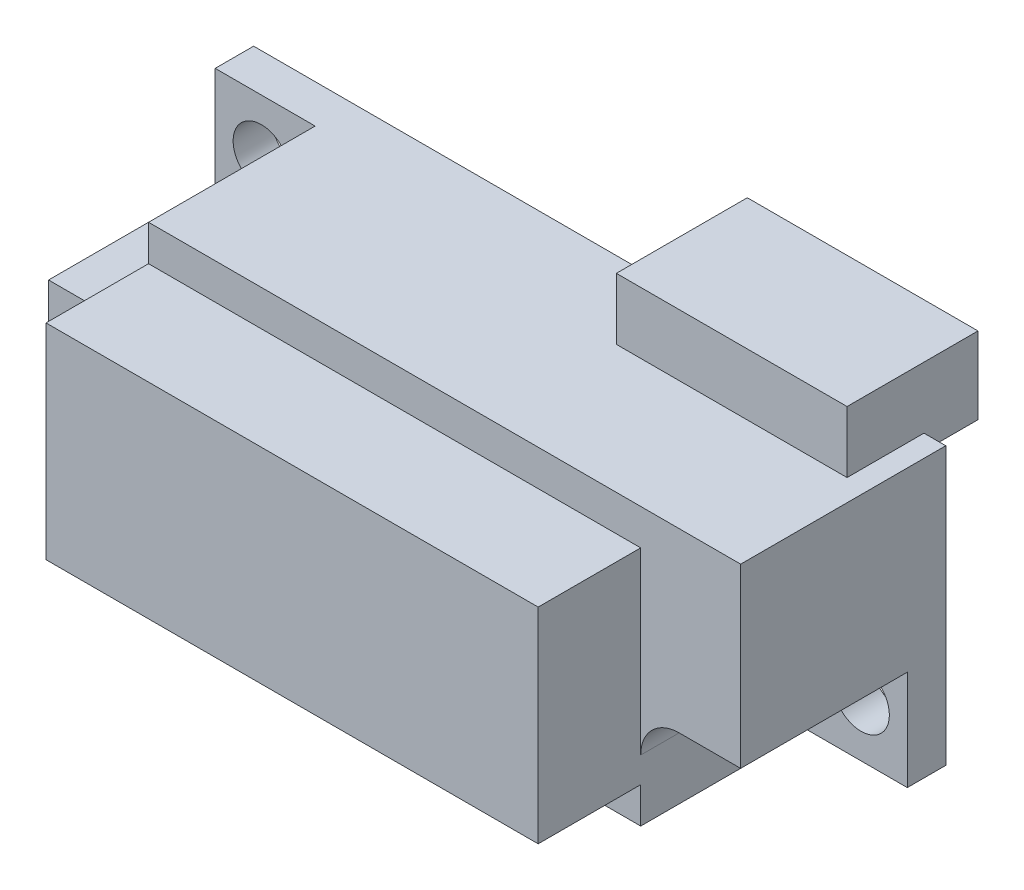
ISO-10303-21;
HEADER;
FILE_DESCRIPTION(('STEP AP214'),'2;1');
FILE_NAME('part.step','',(''),(''),'','','');
FILE_SCHEMA(('AUTOMOTIVE_DESIGN { 1 0 10303 214 1 1 1 1 }'));
ENDSEC;
DATA;
#1=APPLICATION_CONTEXT('core data for automotive mechanical design processes');
#2=APPLICATION_PROTOCOL_DEFINITION('international standard','automotive_design',2000,#1);
#3=PRODUCT_CONTEXT('',#1,'mechanical');
#4=PRODUCT('Part','Part','',(#3));
#5=PRODUCT_RELATED_PRODUCT_CATEGORY('part','',(#4));
#6=PRODUCT_DEFINITION_FORMATION('','',#4);
#7=PRODUCT_DEFINITION_CONTEXT('part definition',#1,'design');
#8=PRODUCT_DEFINITION('design','',#6,#7);
#9=PRODUCT_DEFINITION_SHAPE('','',#8);
#10=(LENGTH_UNIT() NAMED_UNIT(*) SI_UNIT(.MILLI.,.METRE.));
#11=(NAMED_UNIT(*) PLANE_ANGLE_UNIT() SI_UNIT($,.RADIAN.));
#12=(NAMED_UNIT(*) SI_UNIT($,.STERADIAN.) SOLID_ANGLE_UNIT());
#13=UNCERTAINTY_MEASURE_WITH_UNIT(LENGTH_MEASURE(1.E-05),#10,'distance_accuracy_value','');
#14=(GEOMETRIC_REPRESENTATION_CONTEXT(3) GLOBAL_UNCERTAINTY_ASSIGNED_CONTEXT((#13)) GLOBAL_UNIT_ASSIGNED_CONTEXT((#10,
#11,#12)) REPRESENTATION_CONTEXT('',''));
#15=CARTESIAN_POINT('',(0.,0.,0.));
#16=DIRECTION('',(0.,0.,1.));
#17=DIRECTION('',(1.,0.,0.));
#18=AXIS2_PLACEMENT_3D('',#15,#16,#17);
#19=CARTESIAN_POINT('',(-26.1452834227024,14.8512324203786,12.));
#20=DIRECTION('',(1.,0.,0.));
#21=DIRECTION('',(0.,1.,0.));
#22=AXIS2_PLACEMENT_3D('',#19,#20,#21);
#23=PLANE('',#22);
#24=DIRECTION('',(0.,-1.,0.));
#25=VECTOR('',#24,1.);
#26=CARTESIAN_POINT('',(-26.1452834227024,14.8512324203786,8.));
#27=LINE('',#26,#25);
#28=CARTESIAN_POINT('',(-26.1452834227024,10.9512324203803,8.));
#29=VERTEX_POINT('',#28);
#30=CARTESIAN_POINT('',(-26.1452834227024,4.05123242037859,8.));
#31=VERTEX_POINT('',#30);
#32=EDGE_CURVE('E246',#29,#31,#27,.T.);
#33=ORIENTED_EDGE('',*,*,#32,.F.);
#34=DIRECTION('',(0.,0.,1.));
#35=VECTOR('',#34,1.);
#36=CARTESIAN_POINT('',(-26.1452834227024,10.9512324203803,1.5));
#37=LINE('',#36,#35);
#38=CARTESIAN_POINT('',(-26.1452834227024,10.9512324203803,1.5));
#39=VERTEX_POINT('',#38);
#40=EDGE_CURVE('E311',#39,#29,#37,.T.);
#41=ORIENTED_EDGE('',*,*,#40,.F.);
#42=DIRECTION('',(0.,-1.,0.));
#43=VECTOR('',#42,1.);
#44=CARTESIAN_POINT('',(-26.1452834227024,14.8512324203786,1.5));
#45=LINE('',#44,#43);
#46=CARTESIAN_POINT('',(-26.1452834227024,14.8512324203786,1.5));
#47=VERTEX_POINT('',#46);
#48=EDGE_CURVE('E301',#47,#39,#45,.T.);
#49=ORIENTED_EDGE('',*,*,#48,.F.);
#50=DIRECTION('',(0.,0.,-1.));
#51=VECTOR('',#50,1.);
#52=CARTESIAN_POINT('',(-26.1452834227024,14.8512324203786,12.));
#53=LINE('',#52,#51);
#54=CARTESIAN_POINT('',(-26.1452834227024,14.8512324203786,0.));
#55=VERTEX_POINT('',#54);
#56=EDGE_CURVE('E332',#47,#55,#53,.T.);
#57=ORIENTED_EDGE('',*,*,#56,.T.);
#58=DIRECTION('',(0.,-1.,0.));
#59=VECTOR('',#58,1.);
#60=CARTESIAN_POINT('',(-26.1452834227024,14.8512324203786,0.));
#61=LINE('',#60,#59);
#62=CARTESIAN_POINT('',(-26.1452834227025,4.05123242037859,0.));
#63=VERTEX_POINT('',#62);
#64=EDGE_CURVE('E317',#55,#63,#61,.T.);
#65=ORIENTED_EDGE('',*,*,#64,.T.);
#66=DIRECTION('',(0.,0.,-1.));
#67=VECTOR('',#66,1.);
#68=CARTESIAN_POINT('',(-26.1452834227025,4.05123242037859,12.));
#69=LINE('',#68,#67);
#70=EDGE_CURVE('E339',#31,#63,#69,.T.);
#71=ORIENTED_EDGE('',*,*,#70,.F.);
#72=EDGE_LOOP('',(#33,#41,#49,#57,#65,#71));
#73=FACE_BOUND('',#72,.T.);
#74=ADVANCED_FACE('F35',(#73),#23,.F.);
#75=CARTESIAN_POINT('',(-26.1452834227025,4.05123242037859,12.));
#76=DIRECTION('',(0.,1.,0.));
#77=DIRECTION('',(0.,0.,1.));
#78=AXIS2_PLACEMENT_3D('',#75,#76,#77);
#79=PLANE('',#78);
#80=DIRECTION('',(1.,0.,0.));
#81=VECTOR('',#80,1.);
#82=CARTESIAN_POINT('',(-26.1452834227024,4.05123242037859,8.));
#83=LINE('',#82,#81);
#84=CARTESIAN_POINT('',(-3.04528342269798,4.05123242037859,8.));
#85=VERTEX_POINT('',#84);
#86=EDGE_CURVE('E255',#31,#85,#83,.T.);
#87=ORIENTED_EDGE('',*,*,#86,.F.);
#88=ORIENTED_EDGE('',*,*,#70,.T.);
#89=DIRECTION('',(1.,0.,0.));
#90=VECTOR('',#89,1.);
#91=CARTESIAN_POINT('',(-26.1452834227025,4.05123242037859,0.));
#92=LINE('',#91,#90);
#93=CARTESIAN_POINT('',(0.85471657729755,4.05123242037859,0.));
#94=VERTEX_POINT('',#93);
#95=EDGE_CURVE('E322',#63,#94,#92,.T.);
#96=ORIENTED_EDGE('',*,*,#95,.T.);
#97=DIRECTION('',(0.,0.,-1.));
#98=VECTOR('',#97,1.);
#99=CARTESIAN_POINT('',(0.85471657729755,4.05123242037859,12.));
#100=LINE('',#99,#98);
#101=CARTESIAN_POINT('',(0.85471657729755,4.05123242037859,1.5));
#102=VERTEX_POINT('',#101);
#103=EDGE_CURVE('E337',#102,#94,#100,.T.);
#104=ORIENTED_EDGE('',*,*,#103,.F.);
#105=DIRECTION('',(1.,0.,0.));
#106=VECTOR('',#105,1.);
#107=CARTESIAN_POINT('',(-3.04528342269798,4.05123242037859,1.5));
#108=LINE('',#107,#106);
#109=CARTESIAN_POINT('',(-3.04528342269798,4.05123242037859,1.5));
#110=VERTEX_POINT('',#109);
#111=EDGE_CURVE('E286',#110,#102,#108,.T.);
#112=ORIENTED_EDGE('',*,*,#111,.F.);
#113=DIRECTION('',(0.,0.,1.));
#114=VECTOR('',#113,1.);
#115=CARTESIAN_POINT('',(-3.04528342269798,4.05123242037859,1.5));
#116=LINE('',#115,#114);
#117=EDGE_CURVE('E292',#110,#85,#116,.T.);
#118=ORIENTED_EDGE('',*,*,#117,.T.);
#119=EDGE_LOOP('',(#87,#88,#96,#104,#112,#118));
#120=FACE_BOUND('',#119,.T.);
#121=ADVANCED_FACE('F409',(#120),#79,.F.);
#122=CARTESIAN_POINT('',(0.854716577297548,14.8512324203786,12.));
#123=DIRECTION('',(-1.,0.,0.));
#124=DIRECTION('',(0.,-1.,0.));
#125=AXIS2_PLACEMENT_3D('',#122,#123,#124);
#126=PLANE('',#125);
#127=DIRECTION('',(0.,1.,0.));
#128=VECTOR('',#127,1.);
#129=CARTESIAN_POINT('',(0.85471657729755,14.8512324203786,8.));
#130=LINE('',#129,#128);
#131=CARTESIAN_POINT('',(0.85471657729755,7.95123242037313,8.));
#132=VERTEX_POINT('',#131);
#133=CARTESIAN_POINT('',(0.85471657729755,14.8512324203786,8.));
#134=VERTEX_POINT('',#133);
#135=EDGE_CURVE('E257',#132,#134,#130,.T.);
#136=ORIENTED_EDGE('',*,*,#135,.F.);
#137=DIRECTION('',(0.,0.,1.));
#138=VECTOR('',#137,1.);
#139=CARTESIAN_POINT('',(0.85471657729755,7.95123242037313,1.5));
#140=LINE('',#139,#138);
#141=CARTESIAN_POINT('',(0.85471657729755,7.95123242037313,1.5));
#142=VERTEX_POINT('',#141);
#143=EDGE_CURVE('E295',#142,#132,#140,.T.);
#144=ORIENTED_EDGE('',*,*,#143,.F.);
#145=DIRECTION('',(0.,1.,0.));
#146=VECTOR('',#145,1.);
#147=CARTESIAN_POINT('',(0.85471657729755,7.95123242037313,1.5));
#148=LINE('',#147,#146);
#149=EDGE_CURVE('E288',#102,#142,#148,.T.);
#150=ORIENTED_EDGE('',*,*,#149,.F.);
#151=ORIENTED_EDGE('',*,*,#103,.T.);
#152=DIRECTION('',(0.,1.,0.));
#153=VECTOR('',#152,1.);
#154=CARTESIAN_POINT('',(0.854716577297548,14.8512324203786,0.));
#155=LINE('',#154,#153);
#156=CARTESIAN_POINT('',(0.854716577297548,14.8512324203786,0.));
#157=VERTEX_POINT('',#156);
#158=EDGE_CURVE('E325',#94,#157,#155,.T.);
#159=ORIENTED_EDGE('',*,*,#158,.T.);
#160=DIRECTION('',(0.,0.,-1.));
#161=VECTOR('',#160,1.);
#162=CARTESIAN_POINT('',(0.854716577297548,14.8512324203786,12.));
#163=LINE('',#162,#161);
#164=EDGE_CURVE('E335',#134,#157,#163,.T.);
#165=ORIENTED_EDGE('',*,*,#164,.F.);
#166=EDGE_LOOP('',(#136,#144,#150,#151,#159,#165));
#167=FACE_BOUND('',#166,.T.);
#168=ADVANCED_FACE('F371',(#167),#126,.F.);
#169=CARTESIAN_POINT('',(-26.1452834227024,14.8512324203786,12.));
#170=DIRECTION('',(0.,-1.,0.));
#171=DIRECTION('',(0.,0.,-1.));
#172=AXIS2_PLACEMENT_3D('',#169,#170,#171);
#173=PLANE('',#172);
#174=DIRECTION('',(-1.,0.,0.));
#175=VECTOR('',#174,1.);
#176=CARTESIAN_POINT('',(-26.1452834227024,14.8512324203786,0.));
#177=LINE('',#176,#175);
#178=CARTESIAN_POINT('',(0.00471657729754944,14.8512324203786,0.));
#179=VERTEX_POINT('',#178);
#180=EDGE_CURVE('E329',#157,#179,#177,.T.);
#181=ORIENTED_EDGE('',*,*,#180,.T.);
#182=DIRECTION('',(0.,0.,1.));
#183=VECTOR('',#182,1.);
#184=CARTESIAN_POINT('',(0.00471657729755187,14.8512324203786,12.));
#185=LINE('',#184,#183);
#186=CARTESIAN_POINT('',(0.00471657729754944,14.8512324203786,3.));
#187=VERTEX_POINT('',#186);
#188=EDGE_CURVE('E224',#179,#187,#185,.T.);
#189=ORIENTED_EDGE('',*,*,#188,.T.);
#190=DIRECTION('',(1.,0.,0.));
#191=VECTOR('',#190,1.);
#192=CARTESIAN_POINT('',(-26.1452834227024,14.8512324203786,3.));
#193=LINE('',#192,#191);
#194=CARTESIAN_POINT('',(-8.99528342270245,14.8512324203786,3.));
#195=VERTEX_POINT('',#194);
#196=EDGE_CURVE('E11',#195,#187,#193,.T.);
#197=ORIENTED_EDGE('',*,*,#196,.F.);
#198=DIRECTION('',(0.,0.,-1.));
#199=VECTOR('',#198,1.);
#200=CARTESIAN_POINT('',(-8.99528342270245,14.8512324203786,12.));
#201=LINE('',#200,#199);
#202=CARTESIAN_POINT('',(-8.99528342270245,14.8512324203786,0.));
#203=VERTEX_POINT('',#202);
#204=EDGE_CURVE('E218',#195,#203,#201,.T.);
#205=ORIENTED_EDGE('',*,*,#204,.T.);
#206=EDGE_CURVE('E328',#203,#55,#177,.T.);
#207=ORIENTED_EDGE('',*,*,#206,.T.);
#208=ORIENTED_EDGE('',*,*,#56,.F.);
#209=DIRECTION('',(-1.,0.,0.));
#210=VECTOR('',#209,1.);
#211=CARTESIAN_POINT('',(-26.1452834227024,14.8512324203786,1.5));
#212=LINE('',#211,#210);
#213=CARTESIAN_POINT('',(-22.245283422704,14.8512324203786,1.5));
#214=VERTEX_POINT('',#213);
#215=EDGE_CURVE('E309',#214,#47,#212,.T.);
#216=ORIENTED_EDGE('',*,*,#215,.F.);
#217=DIRECTION('',(0.,0.,1.));
#218=VECTOR('',#217,1.);
#219=CARTESIAN_POINT('',(-22.245283422704,14.8512324203786,1.5));
#220=LINE('',#219,#218);
#221=CARTESIAN_POINT('',(-22.245283422704,14.8512324203786,8.));
#222=VERTEX_POINT('',#221);
#223=EDGE_CURVE('E314',#214,#222,#220,.T.);
#224=ORIENTED_EDGE('',*,*,#223,.T.);
#225=DIRECTION('',(-1.,0.,0.));
#226=VECTOR('',#225,1.);
#227=CARTESIAN_POINT('',(-26.1452834227024,14.8512324203786,8.));
#228=LINE('',#227,#226);
#229=EDGE_CURVE('E259',#134,#222,#228,.T.);
#230=ORIENTED_EDGE('',*,*,#229,.F.);
#231=ORIENTED_EDGE('',*,*,#164,.T.);
#232=EDGE_LOOP('',(#181,#189,#197,#205,#207,#208,#216,#224,#230,#231));
#233=FACE_BOUND('',#232,.T.);
#234=ADVANCED_FACE('F365',(#233),#173,.F.);
#235=CARTESIAN_POINT('',(0.,0.,12.));
#236=DIRECTION('',(0.,0.,1.));
#237=DIRECTION('',(1.,0.,0.));
#238=AXIS2_PLACEMENT_3D('',#235,#236,#237);
#239=PLANE('',#238);
#240=DIRECTION('',(0.,-1.,0.));
#241=VECTOR('',#240,1.);
#242=CARTESIAN_POINT('',(-3.04528342269798,7.95123242037313,12.));
#243=LINE('',#242,#241);
#244=CARTESIAN_POINT('',(-3.04528342270245,13.4512324203786,12.));
#245=VERTEX_POINT('',#244);
#246=CARTESIAN_POINT('',(-3.04528342270245,5.4512324203786,12.));
#247=VERTEX_POINT('',#246);
#248=EDGE_CURVE('E283',#245,#247,#243,.T.);
#249=ORIENTED_EDGE('',*,*,#248,.F.);
#250=DIRECTION('',(-1.,0.,0.));
#251=VECTOR('',#250,1.);
#252=CARTESIAN_POINT('',(-22.2452834227024,13.4512324203786,12.));
#253=LINE('',#252,#251);
#254=CARTESIAN_POINT('',(-22.2452834227024,13.4512324203786,12.));
#255=VERTEX_POINT('',#254);
#256=EDGE_CURVE('E231',#245,#255,#253,.T.);
#257=ORIENTED_EDGE('',*,*,#256,.T.);
#258=DIRECTION('',(0.,1.,0.));
#259=VECTOR('',#258,1.);
#260=CARTESIAN_POINT('',(-22.245283422704,14.8512324203786,12.));
#261=LINE('',#260,#259);
#262=CARTESIAN_POINT('',(-22.2452834227024,5.4512324203786,12.));
#263=VERTEX_POINT('',#262);
#264=EDGE_CURVE('E298',#263,#255,#261,.T.);
#265=ORIENTED_EDGE('',*,*,#264,.F.);
#266=DIRECTION('',(1.,0.,0.));
#267=VECTOR('',#266,1.);
#268=CARTESIAN_POINT('',(-22.2452834227024,5.4512324203786,12.));
#269=LINE('',#268,#267);
#270=EDGE_CURVE('E227',#263,#247,#269,.T.);
#271=ORIENTED_EDGE('',*,*,#270,.T.);
#272=EDGE_LOOP('',(#249,#257,#265,#271));
#273=FACE_BOUND('',#272,.T.);
#274=ADVANCED_FACE('F455',(#273),#239,.T.);
#275=CARTESIAN_POINT('',(-26.1452834227024,10.9512324203803,1.5));
#276=DIRECTION('',(0.,-1.,0.));
#277=DIRECTION('',(0.,0.,-1.));
#278=AXIS2_PLACEMENT_3D('',#275,#276,#277);
#279=PLANE('',#278);
#280=DIRECTION('',(-1.,0.,0.));
#281=VECTOR('',#280,1.);
#282=CARTESIAN_POINT('',(-26.1452834227024,10.9512324203803,8.));
#283=LINE('',#282,#281);
#284=CARTESIAN_POINT('',(-23.745283422704,10.9512324203803,8.));
#285=VERTEX_POINT('',#284);
#286=EDGE_CURVE('E265',#285,#29,#283,.T.);
#287=ORIENTED_EDGE('',*,*,#286,.F.);
#288=DIRECTION('',(0.,0.,1.));
#289=VECTOR('',#288,1.);
#290=CARTESIAN_POINT('',(-23.745283422704,10.9512324203803,1.5));
#291=LINE('',#290,#289);
#292=CARTESIAN_POINT('',(-23.745283422704,10.9512324203803,1.5));
#293=VERTEX_POINT('',#292);
#294=EDGE_CURVE('E344',#285,#293,#291,.F.);
#295=ORIENTED_EDGE('',*,*,#294,.T.);
#296=DIRECTION('',(1.,0.,0.));
#297=VECTOR('',#296,1.);
#298=CARTESIAN_POINT('',(-26.1452834227024,10.9512324203803,1.5));
#299=LINE('',#298,#297);
#300=EDGE_CURVE('E304',#39,#293,#299,.T.);
#301=ORIENTED_EDGE('',*,*,#300,.F.);
#302=ORIENTED_EDGE('',*,*,#40,.T.);
#303=EDGE_LOOP('',(#287,#295,#301,#302));
#304=FACE_BOUND('',#303,.T.);
#305=ADVANCED_FACE('F425',(#304),#279,.F.);
#306=CARTESIAN_POINT('',(-3.04528342269798,7.95123242037313,1.5));
#307=DIRECTION('',(0.,1.,0.));
#308=DIRECTION('',(0.,0.,1.));
#309=AXIS2_PLACEMENT_3D('',#306,#307,#308);
#310=PLANE('',#309);
#311=DIRECTION('',(1.,0.,0.));
#312=VECTOR('',#311,1.);
#313=CARTESIAN_POINT('',(-3.04528342269798,7.95123242037313,8.));
#314=LINE('',#313,#312);
#315=CARTESIAN_POINT('',(-1.54528342269798,7.95123242037313,8.));
#316=VERTEX_POINT('',#315);
#317=EDGE_CURVE('E261',#316,#132,#314,.T.);
#318=ORIENTED_EDGE('',*,*,#317,.F.);
#319=DIRECTION('',(0.,0.,1.));
#320=VECTOR('',#319,1.);
#321=CARTESIAN_POINT('',(-1.54528342269798,7.95123242037313,1.5));
#322=LINE('',#321,#320);
#323=CARTESIAN_POINT('',(-1.54528342269798,7.95123242037313,1.5));
#324=VERTEX_POINT('',#323);
#325=EDGE_CURVE('E58',#316,#324,#322,.F.);
#326=ORIENTED_EDGE('',*,*,#325,.T.);
#327=DIRECTION('',(-1.,0.,0.));
#328=VECTOR('',#327,1.);
#329=CARTESIAN_POINT('',(-3.04528342269798,7.95123242037313,1.5));
#330=LINE('',#329,#328);
#331=EDGE_CURVE('E290',#142,#324,#330,.T.);
#332=ORIENTED_EDGE('',*,*,#331,.F.);
#333=ORIENTED_EDGE('',*,*,#143,.T.);
#334=EDGE_LOOP('',(#318,#326,#332,#333));
#335=FACE_BOUND('',#334,.T.);
#336=ADVANCED_FACE('F418',(#335),#310,.F.);
#337=CARTESIAN_POINT('',(-23.745283422704,12.4512324203803,1.5));
#338=DIRECTION('',(0.,0.,-1.));
#339=DIRECTION('',(-1.,0.,0.));
#340=AXIS2_PLACEMENT_3D('',#337,#338,#339);
#341=CYLINDRICAL_SURFACE('',#340,1.5);
#342=CARTESIAN_POINT('',(-23.745283422704,12.4512324203803,8.));
#343=DIRECTION('',(0.,0.,1.));
#344=DIRECTION('',(1.,0.,0.));
#345=AXIS2_PLACEMENT_3D('',#342,#343,#344);
#346=CIRCLE('',#345,1.5);
#347=CARTESIAN_POINT('',(-22.2452834227024,12.4512324203803,8.));
#348=VERTEX_POINT('',#347);
#349=EDGE_CURVE('E263',#348,#285,#346,.F.);
#350=ORIENTED_EDGE('',*,*,#349,.F.);
#351=DIRECTION('',(0.,0.,1.));
#352=VECTOR('',#351,1.);
#353=CARTESIAN_POINT('',(-22.245283422704,12.4512324203803,12.));
#354=LINE('',#353,#352);
#355=CARTESIAN_POINT('',(-22.245283422704,12.4512324203803,1.5));
#356=VERTEX_POINT('',#355);
#357=EDGE_CURVE('E341',#356,#348,#354,.T.);
#358=ORIENTED_EDGE('',*,*,#357,.F.);
#359=CARTESIAN_POINT('',(-23.745283422704,12.4512324203803,1.5));
#360=DIRECTION('',(0.,0.,1.));
#361=DIRECTION('',(1.,0.,0.));
#362=AXIS2_PLACEMENT_3D('',#359,#360,#361);
#363=CIRCLE('',#362,1.5);
#364=EDGE_CURVE('E346',#293,#356,#363,.T.);
#365=ORIENTED_EDGE('',*,*,#364,.F.);
#366=ORIENTED_EDGE('',*,*,#294,.F.);
#367=EDGE_LOOP('',(#350,#358,#365,#366));
#368=FACE_BOUND('',#367,.T.);
#369=ADVANCED_FACE('F416',(#368),#341,.F.);
#370=CARTESIAN_POINT('',(-1.54528342269798,6.45123242037313,1.5));
#371=DIRECTION('',(0.,0.,-1.));
#372=DIRECTION('',(-1.,0.,0.));
#373=AXIS2_PLACEMENT_3D('',#370,#371,#372);
#374=CYLINDRICAL_SURFACE('',#373,1.5);
#375=CARTESIAN_POINT('',(-1.54528342269798,6.45123242037313,8.));
#376=DIRECTION('',(0.,0.,1.));
#377=DIRECTION('',(1.,0.,0.));
#378=AXIS2_PLACEMENT_3D('',#375,#376,#377);
#379=CIRCLE('',#378,1.5);
#380=CARTESIAN_POINT('',(-3.04528342270245,6.45123242037313,8.));
#381=VERTEX_POINT('',#380);
#382=EDGE_CURVE('E354',#381,#316,#379,.F.);
#383=ORIENTED_EDGE('',*,*,#382,.F.);
#384=DIRECTION('',(0.,0.,1.));
#385=VECTOR('',#384,1.);
#386=CARTESIAN_POINT('',(-3.04528342269798,6.45123242037313,12.));
#387=LINE('',#386,#385);
#388=CARTESIAN_POINT('',(-3.04528342269798,6.45123242037313,1.5));
#389=VERTEX_POINT('',#388);
#390=EDGE_CURVE('E348',#389,#381,#387,.T.);
#391=ORIENTED_EDGE('',*,*,#390,.F.);
#392=CARTESIAN_POINT('',(-1.54528342269798,6.45123242037313,1.5));
#393=DIRECTION('',(0.,0.,1.));
#394=DIRECTION('',(1.,0.,0.));
#395=AXIS2_PLACEMENT_3D('',#392,#393,#394);
#396=CIRCLE('',#395,1.5);
#397=EDGE_CURVE('E352',#324,#389,#396,.T.);
#398=ORIENTED_EDGE('',*,*,#397,.F.);
#399=ORIENTED_EDGE('',*,*,#325,.F.);
#400=EDGE_LOOP('',(#383,#391,#398,#399));
#401=FACE_BOUND('',#400,.T.);
#402=ADVANCED_FACE('F37',(#401),#374,.F.);
#403=CARTESIAN_POINT('',(0.,0.,0.));
#404=DIRECTION('',(0.,0.,1.));
#405=DIRECTION('',(1.,0.,0.));
#406=AXIS2_PLACEMENT_3D('',#403,#404,#405);
#407=PLANE('',#406);
#408=CARTESIAN_POINT('',(-0.94528342270245,6.1512324203786,0.));
#409=DIRECTION('',(0.,0.,1.));
#410=DIRECTION('',(1.,0.,0.));
#411=AXIS2_PLACEMENT_3D('',#408,#409,#410);
#412=CIRCLE('',#411,1.1);
#413=CARTESIAN_POINT('',(0.15471657729755,6.1512324203786,0.));
#414=VERTEX_POINT('',#413);
#415=EDGE_CURVE('E274',#414,#414,#412,.T.);
#416=ORIENTED_EDGE('',*,*,#415,.T.);
#417=EDGE_LOOP('',(#416));
#418=FACE_BOUND('',#417,.T.);
#419=CARTESIAN_POINT('',(-24.3452834227024,12.7512324203786,0.));
#420=DIRECTION('',(0.,0.,1.));
#421=DIRECTION('',(1.,0.,0.));
#422=AXIS2_PLACEMENT_3D('',#419,#420,#421);
#423=CIRCLE('',#422,1.1);
#424=CARTESIAN_POINT('',(-23.2452834227024,12.7512324203786,0.));
#425=VERTEX_POINT('',#424);
#426=EDGE_CURVE('E280',#425,#425,#423,.T.);
#427=ORIENTED_EDGE('',*,*,#426,.T.);
#428=EDGE_LOOP('',(#427));
#429=FACE_BOUND('',#428,.T.);
#430=DIRECTION('',(1.,0.,0.));
#431=VECTOR('',#430,1.);
#432=CARTESIAN_POINT('',(0.,14.2512324203786,0.));
#433=LINE('',#432,#431);
#434=CARTESIAN_POINT('',(-8.99528342270245,14.2512324203786,0.));
#435=VERTEX_POINT('',#434);
#436=CARTESIAN_POINT('',(0.00471657729754927,14.2512324203786,0.));
#437=VERTEX_POINT('',#436);
#438=EDGE_CURVE('E356',#435,#437,#433,.T.);
#439=ORIENTED_EDGE('',*,*,#438,.T.);
#440=DIRECTION('',(0.,1.,0.));
#441=VECTOR('',#440,1.);
#442=CARTESIAN_POINT('',(0.00471657729754515,0.,0.));
#443=LINE('',#442,#441);
#444=EDGE_CURVE('E43',#437,#179,#443,.T.);
#445=ORIENTED_EDGE('',*,*,#444,.T.);
#446=ORIENTED_EDGE('',*,*,#180,.F.);
#447=ORIENTED_EDGE('',*,*,#158,.F.);
#448=ORIENTED_EDGE('',*,*,#95,.F.);
#449=ORIENTED_EDGE('',*,*,#64,.F.);
#450=ORIENTED_EDGE('',*,*,#206,.F.);
#451=DIRECTION('',(0.,-1.,0.));
#452=VECTOR('',#451,1.);
#453=CARTESIAN_POINT('',(-8.99528342270244,0.,0.));
#454=LINE('',#453,#452);
#455=EDGE_CURVE('E358',#203,#435,#454,.T.);
#456=ORIENTED_EDGE('',*,*,#455,.T.);
#457=EDGE_LOOP('',(#439,#445,#446,#447,#448,#449,#450,#456));
#458=FACE_BOUND('',#457,.T.);
#459=ADVANCED_FACE('F362',(#418,#429,#458),#407,.F.);
#460=CARTESIAN_POINT('',(-22.245283422704,14.8512324203786,1.5));
#461=DIRECTION('',(1.,0.,0.));
#462=DIRECTION('',(0.,0.,-1.));
#463=AXIS2_PLACEMENT_3D('',#460,#461,#462);
#464=PLANE('',#463);
#465=DIRECTION('',(0.,0.,1.));
#466=VECTOR('',#465,1.);
#467=CARTESIAN_POINT('',(-22.2452834227024,13.4512324203786,8.));
#468=LINE('',#467,#466);
#469=CARTESIAN_POINT('',(-22.2452834227024,13.4512324203786,8.));
#470=VERTEX_POINT('',#469);
#471=EDGE_CURVE('E244',#470,#255,#468,.T.);
#472=ORIENTED_EDGE('',*,*,#471,.F.);
#473=DIRECTION('',(0.,-1.,0.));
#474=VECTOR('',#473,1.);
#475=CARTESIAN_POINT('',(-22.245283422704,14.8512324203786,8.));
#476=LINE('',#475,#474);
#477=EDGE_CURVE('E269',#222,#470,#476,.T.);
#478=ORIENTED_EDGE('',*,*,#477,.F.);
#479=ORIENTED_EDGE('',*,*,#223,.F.);
#480=DIRECTION('',(0.,1.,0.));
#481=VECTOR('',#480,1.);
#482=CARTESIAN_POINT('',(-22.245283422704,14.8512324203786,1.5));
#483=LINE('',#482,#481);
#484=EDGE_CURVE('E307',#356,#214,#483,.T.);
#485=ORIENTED_EDGE('',*,*,#484,.F.);
#486=ORIENTED_EDGE('',*,*,#357,.T.);
#487=DIRECTION('',(0.,-1.,0.));
#488=VECTOR('',#487,1.);
#489=CARTESIAN_POINT('',(-22.2452834227024,13.4512324203786,8.));
#490=LINE('',#489,#488);
#491=CARTESIAN_POINT('',(-22.2452834227024,5.4512324203786,8.));
#492=VERTEX_POINT('',#491);
#493=EDGE_CURVE('E228',#348,#492,#490,.T.);
#494=ORIENTED_EDGE('',*,*,#493,.T.);
#495=DIRECTION('',(0.,0.,1.));
#496=VECTOR('',#495,1.);
#497=CARTESIAN_POINT('',(-22.2452834227024,5.4512324203786,8.));
#498=LINE('',#497,#496);
#499=EDGE_CURVE('E239',#492,#263,#498,.T.);
#500=ORIENTED_EDGE('',*,*,#499,.T.);
#501=ORIENTED_EDGE('',*,*,#264,.T.);
#502=EDGE_LOOP('',(#472,#478,#479,#485,#486,#494,#500,#501));
#503=FACE_BOUND('',#502,.T.);
#504=ADVANCED_FACE('F436',(#503),#464,.F.);
#505=CARTESIAN_POINT('',(0.,0.,1.5));
#506=DIRECTION('',(0.,0.,1.));
#507=DIRECTION('',(1.,0.,0.));
#508=AXIS2_PLACEMENT_3D('',#505,#506,#507);
#509=PLANE('',#508);
#510=CARTESIAN_POINT('',(-24.3452834227024,12.7512324203786,1.5));
#511=DIRECTION('',(0.,0.,1.));
#512=DIRECTION('',(1.,0.,0.));
#513=AXIS2_PLACEMENT_3D('',#510,#511,#512);
#514=CIRCLE('',#513,1.1);
#515=CARTESIAN_POINT('',(-23.2452834227024,12.7512324203786,1.5));
#516=VERTEX_POINT('',#515);
#517=EDGE_CURVE('E277',#516,#516,#514,.T.);
#518=ORIENTED_EDGE('',*,*,#517,.F.);
#519=EDGE_LOOP('',(#518));
#520=FACE_BOUND('',#519,.T.);
#521=ORIENTED_EDGE('',*,*,#300,.T.);
#522=ORIENTED_EDGE('',*,*,#364,.T.);
#523=ORIENTED_EDGE('',*,*,#484,.T.);
#524=ORIENTED_EDGE('',*,*,#215,.T.);
#525=ORIENTED_EDGE('',*,*,#48,.T.);
#526=EDGE_LOOP('',(#521,#522,#523,#524,#525));
#527=FACE_BOUND('',#526,.T.);
#528=ADVANCED_FACE('F441',(#520,#527),#509,.T.);
#529=CARTESIAN_POINT('',(-3.04528342269798,7.95123242037313,1.5));
#530=DIRECTION('',(-1.,0.,0.));
#531=DIRECTION('',(0.,0.,1.));
#532=AXIS2_PLACEMENT_3D('',#529,#530,#531);
#533=PLANE('',#532);
#534=DIRECTION('',(0.,0.,1.));
#535=VECTOR('',#534,1.);
#536=CARTESIAN_POINT('',(-3.04528342270245,5.4512324203786,8.));
#537=LINE('',#536,#535);
#538=CARTESIAN_POINT('',(-3.04528342270245,5.4512324203786,8.));
#539=VERTEX_POINT('',#538);
#540=EDGE_CURVE('E250',#539,#247,#537,.T.);
#541=ORIENTED_EDGE('',*,*,#540,.F.);
#542=DIRECTION('',(0.,1.,0.));
#543=VECTOR('',#542,1.);
#544=CARTESIAN_POINT('',(-3.04528342269798,7.95123242037313,8.));
#545=LINE('',#544,#543);
#546=EDGE_CURVE('E267',#85,#539,#545,.T.);
#547=ORIENTED_EDGE('',*,*,#546,.F.);
#548=ORIENTED_EDGE('',*,*,#117,.F.);
#549=DIRECTION('',(0.,-1.,0.));
#550=VECTOR('',#549,1.);
#551=CARTESIAN_POINT('',(-3.04528342269798,7.95123242037313,1.5));
#552=LINE('',#551,#550);
#553=EDGE_CURVE('E284',#389,#110,#552,.T.);
#554=ORIENTED_EDGE('',*,*,#553,.F.);
#555=ORIENTED_EDGE('',*,*,#390,.T.);
#556=DIRECTION('',(0.,1.,0.));
#557=VECTOR('',#556,1.);
#558=CARTESIAN_POINT('',(-3.04528342270245,13.4512324203786,8.));
#559=LINE('',#558,#557);
#560=CARTESIAN_POINT('',(-3.04528342270245,13.4512324203786,8.));
#561=VERTEX_POINT('',#560);
#562=EDGE_CURVE('E234',#381,#561,#559,.T.);
#563=ORIENTED_EDGE('',*,*,#562,.T.);
#564=DIRECTION('',(0.,0.,1.));
#565=VECTOR('',#564,1.);
#566=CARTESIAN_POINT('',(-3.04528342270245,13.4512324203786,8.));
#567=LINE('',#566,#565);
#568=EDGE_CURVE('E247',#561,#245,#567,.T.);
#569=ORIENTED_EDGE('',*,*,#568,.T.);
#570=ORIENTED_EDGE('',*,*,#248,.T.);
#571=EDGE_LOOP('',(#541,#547,#548,#554,#555,#563,#569,#570));
#572=FACE_BOUND('',#571,.T.);
#573=ADVANCED_FACE('F450',(#572),#533,.F.);
#574=CARTESIAN_POINT('',(0.,0.,1.5));
#575=DIRECTION('',(0.,0.,1.));
#576=DIRECTION('',(1.,0.,0.));
#577=AXIS2_PLACEMENT_3D('',#574,#575,#576);
#578=PLANE('',#577);
#579=CARTESIAN_POINT('',(-0.94528342270245,6.1512324203786,1.5));
#580=DIRECTION('',(0.,0.,1.));
#581=DIRECTION('',(1.,0.,0.));
#582=AXIS2_PLACEMENT_3D('',#579,#580,#581);
#583=CIRCLE('',#582,1.1);
#584=CARTESIAN_POINT('',(0.15471657729755,6.1512324203786,1.5));
#585=VERTEX_POINT('',#584);
#586=EDGE_CURVE('E271',#585,#585,#583,.T.);
#587=ORIENTED_EDGE('',*,*,#586,.F.);
#588=EDGE_LOOP('',(#587));
#589=FACE_BOUND('',#588,.T.);
#590=ORIENTED_EDGE('',*,*,#331,.T.);
#591=ORIENTED_EDGE('',*,*,#397,.T.);
#592=ORIENTED_EDGE('',*,*,#553,.T.);
#593=ORIENTED_EDGE('',*,*,#111,.T.);
#594=ORIENTED_EDGE('',*,*,#149,.T.);
#595=EDGE_LOOP('',(#590,#591,#592,#593,#594));
#596=FACE_BOUND('',#595,.T.);
#597=ADVANCED_FACE('F467',(#589,#596),#578,.T.);
#598=CARTESIAN_POINT('',(-24.3452834227024,12.7512324203786,-0.600000000000001));
#599=DIRECTION('',(0.,0.,1.));
#600=DIRECTION('',(1.,0.,0.));
#601=AXIS2_PLACEMENT_3D('',#598,#599,#600);
#602=CYLINDRICAL_SURFACE('',#601,1.1);
#603=ORIENTED_EDGE('',*,*,#517,.T.);
#604=EDGE_LOOP('',(#603));
#605=FACE_BOUND('',#604,.T.);
#606=ORIENTED_EDGE('',*,*,#426,.F.);
#607=EDGE_LOOP('',(#606));
#608=FACE_BOUND('',#607,.T.);
#609=ADVANCED_FACE('F469',(#605,#608),#602,.F.);
#610=CARTESIAN_POINT('',(-0.94528342270245,6.1512324203786,-0.600000000000001));
#611=DIRECTION('',(0.,0.,1.));
#612=DIRECTION('',(1.,0.,0.));
#613=AXIS2_PLACEMENT_3D('',#610,#611,#612);
#614=CYLINDRICAL_SURFACE('',#613,1.1);
#615=ORIENTED_EDGE('',*,*,#586,.T.);
#616=EDGE_LOOP('',(#615));
#617=FACE_BOUND('',#616,.T.);
#618=ORIENTED_EDGE('',*,*,#415,.F.);
#619=EDGE_LOOP('',(#618));
#620=FACE_BOUND('',#619,.T.);
#621=ADVANCED_FACE('F476',(#617,#620),#614,.F.);
#622=CARTESIAN_POINT('',(0.,0.,8.));
#623=DIRECTION('',(0.,0.,1.));
#624=DIRECTION('',(1.,0.,0.));
#625=AXIS2_PLACEMENT_3D('',#622,#623,#624);
#626=PLANE('',#625);
#627=ORIENTED_EDGE('',*,*,#477,.T.);
#628=DIRECTION('',(-1.,0.,0.));
#629=VECTOR('',#628,1.);
#630=CARTESIAN_POINT('',(-22.2452834227024,13.4512324203786,8.));
#631=LINE('',#630,#629);
#632=EDGE_CURVE('E236',#561,#470,#631,.T.);
#633=ORIENTED_EDGE('',*,*,#632,.F.);
#634=ORIENTED_EDGE('',*,*,#562,.F.);
#635=ORIENTED_EDGE('',*,*,#382,.T.);
#636=ORIENTED_EDGE('',*,*,#317,.T.);
#637=ORIENTED_EDGE('',*,*,#135,.T.);
#638=ORIENTED_EDGE('',*,*,#229,.T.);
#639=EDGE_LOOP('',(#627,#633,#634,#635,#636,#637,#638));
#640=FACE_BOUND('',#639,.T.);
#641=ADVANCED_FACE('F462',(#640),#626,.T.);
#642=CARTESIAN_POINT('',(-22.2452834227024,13.4512324203786,8.));
#643=DIRECTION('',(0.,1.,0.));
#644=DIRECTION('',(0.,0.,1.));
#645=AXIS2_PLACEMENT_3D('',#642,#643,#644);
#646=PLANE('',#645);
#647=ORIENTED_EDGE('',*,*,#256,.F.);
#648=ORIENTED_EDGE('',*,*,#568,.F.);
#649=ORIENTED_EDGE('',*,*,#632,.T.);
#650=ORIENTED_EDGE('',*,*,#471,.T.);
#651=EDGE_LOOP('',(#647,#648,#649,#650));
#652=FACE_BOUND('',#651,.T.);
#653=ADVANCED_FACE('F459',(#652),#646,.T.);
#654=ORIENTED_EDGE('',*,*,#546,.T.);
#655=DIRECTION('',(1.,0.,0.));
#656=VECTOR('',#655,1.);
#657=CARTESIAN_POINT('',(-22.2452834227024,5.4512324203786,8.));
#658=LINE('',#657,#656);
#659=EDGE_CURVE('E230',#492,#539,#658,.T.);
#660=ORIENTED_EDGE('',*,*,#659,.F.);
#661=ORIENTED_EDGE('',*,*,#493,.F.);
#662=ORIENTED_EDGE('',*,*,#349,.T.);
#663=ORIENTED_EDGE('',*,*,#286,.T.);
#664=ORIENTED_EDGE('',*,*,#32,.T.);
#665=ORIENTED_EDGE('',*,*,#86,.T.);
#666=EDGE_LOOP('',(#654,#660,#661,#662,#663,#664,#665));
#667=FACE_BOUND('',#666,.T.);
#668=ADVANCED_FACE('F403',(#667),#626,.T.);
#669=CARTESIAN_POINT('',(-22.2452834227024,5.4512324203786,8.));
#670=DIRECTION('',(0.,-1.,0.));
#671=DIRECTION('',(0.,0.,-1.));
#672=AXIS2_PLACEMENT_3D('',#669,#670,#671);
#673=PLANE('',#672);
#674=ORIENTED_EDGE('',*,*,#270,.F.);
#675=ORIENTED_EDGE('',*,*,#499,.F.);
#676=ORIENTED_EDGE('',*,*,#659,.T.);
#677=ORIENTED_EDGE('',*,*,#540,.T.);
#678=EDGE_LOOP('',(#674,#675,#676,#677));
#679=FACE_BOUND('',#678,.T.);
#680=ADVANCED_FACE('F396',(#679),#673,.T.);
#681=CARTESIAN_POINT('',(0.,0.,3.));
#682=DIRECTION('',(0.,0.,-1.));
#683=DIRECTION('',(-1.,0.,0.));
#684=AXIS2_PLACEMENT_3D('',#681,#682,#683);
#685=PLANE('',#684);
#686=DIRECTION('',(0.,1.,0.));
#687=VECTOR('',#686,1.);
#688=CARTESIAN_POINT('',(-8.99528342270245,17.2512324203786,3.));
#689=LINE('',#688,#687);
#690=CARTESIAN_POINT('',(-8.99528342270245,17.2512324203786,3.));
#691=VERTEX_POINT('',#690);
#692=EDGE_CURVE('E212',#195,#691,#689,.T.);
#693=ORIENTED_EDGE('',*,*,#692,.F.);
#694=ORIENTED_EDGE('',*,*,#196,.T.);
#695=DIRECTION('',(0.,-1.,0.));
#696=VECTOR('',#695,1.);
#697=CARTESIAN_POINT('',(0.00471657729755014,17.2512324203786,3.));
#698=LINE('',#697,#696);
#699=CARTESIAN_POINT('',(0.00471657729755014,17.2512324203786,3.));
#700=VERTEX_POINT('',#699);
#701=EDGE_CURVE('E209',#700,#187,#698,.T.);
#702=ORIENTED_EDGE('',*,*,#701,.F.);
#703=DIRECTION('',(1.,0.,0.));
#704=VECTOR('',#703,1.);
#705=CARTESIAN_POINT('',(0.00471657729755014,17.2512324203786,3.));
#706=LINE('',#705,#704);
#707=EDGE_CURVE('E190',#691,#700,#706,.T.);
#708=ORIENTED_EDGE('',*,*,#707,.F.);
#709=EDGE_LOOP('',(#693,#694,#702,#708));
#710=FACE_BOUND('',#709,.T.);
#711=ADVANCED_FACE('F394',(#710),#685,.F.);
#712=CARTESIAN_POINT('',(0.00471657729755014,17.2512324203786,3.));
#713=DIRECTION('',(1.,0.,0.));
#714=DIRECTION('',(0.,1.,0.));
#715=AXIS2_PLACEMENT_3D('',#712,#713,#714);
#716=PLANE('',#715);
#717=ORIENTED_EDGE('',*,*,#188,.F.);
#718=ORIENTED_EDGE('',*,*,#444,.F.);
#719=DIRECTION('',(0.,0.,-1.));
#720=VECTOR('',#719,1.);
#721=CARTESIAN_POINT('',(0.00471657729754927,14.2512324203786,3.));
#722=LINE('',#721,#720);
#723=CARTESIAN_POINT('',(0.00471657729754927,14.2512324203786,-2.108));
#724=VERTEX_POINT('',#723);
#725=EDGE_CURVE('E50',#437,#724,#722,.T.);
#726=ORIENTED_EDGE('',*,*,#725,.T.);
#727=DIRECTION('',(0.,-1.,0.));
#728=VECTOR('',#727,1.);
#729=CARTESIAN_POINT('',(0.00471657729755014,17.2512324203786,-2.108));
#730=LINE('',#729,#728);
#731=CARTESIAN_POINT('',(0.00471657729755014,17.2512324203786,-2.108));
#732=VERTEX_POINT('',#731);
#733=EDGE_CURVE('E186',#732,#724,#730,.T.);
#734=ORIENTED_EDGE('',*,*,#733,.F.);
#735=DIRECTION('',(0.,0.,-1.));
#736=VECTOR('',#735,1.);
#737=CARTESIAN_POINT('',(0.00471657729755014,17.2512324203786,3.));
#738=LINE('',#737,#736);
#739=EDGE_CURVE('E216',#700,#732,#738,.T.);
#740=ORIENTED_EDGE('',*,*,#739,.F.);
#741=ORIENTED_EDGE('',*,*,#701,.T.);
#742=EDGE_LOOP('',(#717,#718,#726,#734,#740,#741));
#743=FACE_BOUND('',#742,.T.);
#744=ADVANCED_FACE('F184',(#743),#716,.T.);
#745=CARTESIAN_POINT('',(-8.99528342270245,17.2512324203786,3.));
#746=DIRECTION('',(-1.,0.,0.));
#747=DIRECTION('',(0.,-1.,0.));
#748=AXIS2_PLACEMENT_3D('',#745,#746,#747);
#749=PLANE('',#748);
#750=ORIENTED_EDGE('',*,*,#204,.F.);
#751=ORIENTED_EDGE('',*,*,#692,.T.);
#752=DIRECTION('',(0.,0.,-1.));
#753=VECTOR('',#752,1.);
#754=CARTESIAN_POINT('',(-8.99528342270245,17.2512324203786,3.));
#755=LINE('',#754,#753);
#756=CARTESIAN_POINT('',(-8.99528342270245,17.2512324203786,-2.108));
#757=VERTEX_POINT('',#756);
#758=EDGE_CURVE('E219',#691,#757,#755,.T.);
#759=ORIENTED_EDGE('',*,*,#758,.T.);
#760=DIRECTION('',(0.,1.,0.));
#761=VECTOR('',#760,1.);
#762=CARTESIAN_POINT('',(-8.99528342270245,17.2512324203786,-2.108));
#763=LINE('',#762,#761);
#764=CARTESIAN_POINT('',(-8.99528342270245,14.2512324203786,-2.108));
#765=VERTEX_POINT('',#764);
#766=EDGE_CURVE('E199',#765,#757,#763,.T.);
#767=ORIENTED_EDGE('',*,*,#766,.F.);
#768=DIRECTION('',(0.,0.,-1.));
#769=VECTOR('',#768,1.);
#770=CARTESIAN_POINT('',(-8.99528342270245,14.2512324203786,3.));
#771=LINE('',#770,#769);
#772=EDGE_CURVE('E189',#435,#765,#771,.T.);
#773=ORIENTED_EDGE('',*,*,#772,.F.);
#774=ORIENTED_EDGE('',*,*,#455,.F.);
#775=EDGE_LOOP('',(#750,#751,#759,#767,#773,#774));
#776=FACE_BOUND('',#775,.T.);
#777=ADVANCED_FACE('F386',(#776),#749,.T.);
#778=CARTESIAN_POINT('',(0.00471657729754927,14.2512324203786,3.));
#779=DIRECTION('',(0.,-1.,0.));
#780=DIRECTION('',(0.,0.,-1.));
#781=AXIS2_PLACEMENT_3D('',#778,#779,#780);
#782=PLANE('',#781);
#783=ORIENTED_EDGE('',*,*,#438,.F.);
#784=ORIENTED_EDGE('',*,*,#772,.T.);
#785=DIRECTION('',(-1.,0.,0.));
#786=VECTOR('',#785,1.);
#787=CARTESIAN_POINT('',(0.00471657729754927,14.2512324203786,-2.108));
#788=LINE('',#787,#786);
#789=EDGE_CURVE('E193',#724,#765,#788,.T.);
#790=ORIENTED_EDGE('',*,*,#789,.F.);
#791=ORIENTED_EDGE('',*,*,#725,.F.);
#792=EDGE_LOOP('',(#783,#784,#790,#791));
#793=FACE_BOUND('',#792,.T.);
#794=ADVANCED_FACE('F194',(#793),#782,.T.);
#795=CARTESIAN_POINT('',(0.00471657729755014,17.2512324203786,3.));
#796=DIRECTION('',(0.,1.,0.));
#797=DIRECTION('',(0.,0.,1.));
#798=AXIS2_PLACEMENT_3D('',#795,#796,#797);
#799=PLANE('',#798);
#800=ORIENTED_EDGE('',*,*,#739,.T.);
#801=DIRECTION('',(1.,0.,0.));
#802=VECTOR('',#801,1.);
#803=CARTESIAN_POINT('',(0.00471657729755014,17.2512324203786,-2.108));
#804=LINE('',#803,#802);
#805=EDGE_CURVE('E204',#757,#732,#804,.T.);
#806=ORIENTED_EDGE('',*,*,#805,.F.);
#807=ORIENTED_EDGE('',*,*,#758,.F.);
#808=ORIENTED_EDGE('',*,*,#707,.T.);
#809=EDGE_LOOP('',(#800,#806,#807,#808));
#810=FACE_BOUND('',#809,.T.);
#811=ADVANCED_FACE('F390',(#810),#799,.T.);
#812=CARTESIAN_POINT('',(0.,0.,-2.108));
#813=DIRECTION('',(0.,0.,-1.));
#814=DIRECTION('',(-1.,0.,0.));
#815=AXIS2_PLACEMENT_3D('',#812,#813,#814);
#816=PLANE('',#815);
#817=ORIENTED_EDGE('',*,*,#733,.T.);
#818=ORIENTED_EDGE('',*,*,#789,.T.);
#819=ORIENTED_EDGE('',*,*,#766,.T.);
#820=ORIENTED_EDGE('',*,*,#805,.T.);
#821=EDGE_LOOP('',(#817,#818,#819,#820));
#822=FACE_BOUND('',#821,.T.);
#823=ADVANCED_FACE('F202',(#822),#816,.T.);
#824=CLOSED_SHELL('',(#74,#121,#168,#234,#274,#305,#336,#369,#402,#459,#504,#528,#573,#597,#609,
#621,#641,#653,#668,#680,#711,#744,#777,#794,#811,#823));
#825=MANIFOLD_SOLID_BREP('B2',#824);
#826=ADVANCED_BREP_SHAPE_REPRESENTATION('',(#18,#825),#14);
#827=SHAPE_DEFINITION_REPRESENTATION(#9,#826);
ENDSEC;
END-ISO-10303-21;
